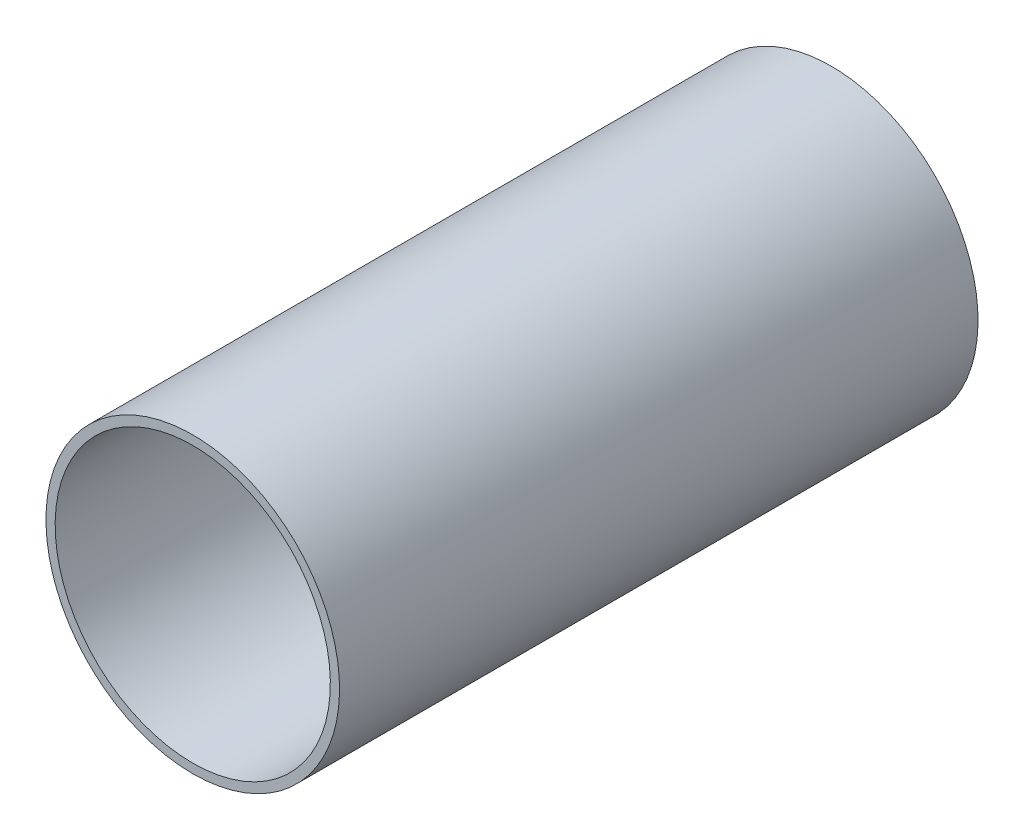
ISO-10303-21;
HEADER;
FILE_DESCRIPTION(('STEP AP214'),'2;1');
FILE_NAME('part.step','',(''),(''),'','','');
FILE_SCHEMA(('AUTOMOTIVE_DESIGN { 1 0 10303 214 1 1 1 1 }'));
ENDSEC;
DATA;
#1=APPLICATION_CONTEXT('core data for automotive mechanical design processes');
#2=APPLICATION_PROTOCOL_DEFINITION('international standard','automotive_design',2000,#1);
#3=PRODUCT_CONTEXT('',#1,'mechanical');
#4=PRODUCT('Part','Part','',(#3));
#5=PRODUCT_RELATED_PRODUCT_CATEGORY('part','',(#4));
#6=PRODUCT_DEFINITION_FORMATION('','',#4);
#7=PRODUCT_DEFINITION_CONTEXT('part definition',#1,'design');
#8=PRODUCT_DEFINITION('design','',#6,#7);
#9=PRODUCT_DEFINITION_SHAPE('','',#8);
#10=(LENGTH_UNIT() NAMED_UNIT(*) SI_UNIT(.MILLI.,.METRE.));
#11=(NAMED_UNIT(*) PLANE_ANGLE_UNIT() SI_UNIT($,.RADIAN.));
#12=(NAMED_UNIT(*) SI_UNIT($,.STERADIAN.) SOLID_ANGLE_UNIT());
#13=UNCERTAINTY_MEASURE_WITH_UNIT(LENGTH_MEASURE(1.E-05),#10,'distance_accuracy_value','');
#14=(GEOMETRIC_REPRESENTATION_CONTEXT(3) GLOBAL_UNCERTAINTY_ASSIGNED_CONTEXT((#13)) GLOBAL_UNIT_ASSIGNED_CONTEXT((#10,
#11,#12)) REPRESENTATION_CONTEXT('',''));
#15=CARTESIAN_POINT('',(0.,0.,0.));
#16=DIRECTION('',(0.,0.,1.));
#17=DIRECTION('',(1.,0.,0.));
#18=AXIS2_PLACEMENT_3D('',#15,#16,#17);
#19=CARTESIAN_POINT('',(134.62,-80.772,-0.045));
#20=DIRECTION('',(0.,0.,-1.));
#21=DIRECTION('',(0.,-1.,0.));
#22=AXIS2_PLACEMENT_3D('',#19,#20,#21);
#23=CYLINDRICAL_SURFACE('',#22,0.375);
#24=CARTESIAN_POINT('',(134.62,-80.772,-0.035));
#25=DIRECTION('',(0.,0.,-1.));
#26=DIRECTION('',(0.,-1.,0.));
#27=AXIS2_PLACEMENT_3D('',#24,#25,#26);
#28=CIRCLE('',#27,0.375);
#29=CARTESIAN_POINT('',(134.62,-81.147,-0.035));
#30=VERTEX_POINT('',#29);
#31=EDGE_CURVE('E64',#30,#30,#28,.T.);
#32=ORIENTED_EDGE('',*,*,#31,.T.);
#33=DIRECTION('',(0.,0.,1.));
#34=VECTOR('',#33,1.);
#35=CARTESIAN_POINT('',(134.62,-81.147,-0.045));
#36=LINE('',#35,#34);
#37=CARTESIAN_POINT('',(134.62,-81.147,1.705));
#38=VERTEX_POINT('',#37);
#39=EDGE_CURVE('E11',#30,#38,#36,.T.);
#40=ORIENTED_EDGE('',*,*,#39,.T.);
#41=CARTESIAN_POINT('',(134.62,-80.772,1.705));
#42=DIRECTION('',(0.,0.,-1.));
#43=DIRECTION('',(0.,-1.,0.));
#44=AXIS2_PLACEMENT_3D('',#41,#42,#43);
#45=CIRCLE('',#44,0.375);
#46=EDGE_CURVE('E25',#38,#38,#45,.T.);
#47=ORIENTED_EDGE('',*,*,#46,.F.);
#48=ORIENTED_EDGE('',*,*,#39,.F.);
#49=EDGE_LOOP('',(#32,#40,#47,#48));
#50=FACE_BOUND('',#49,.T.);
#51=ADVANCED_FACE('F17',(#50),#23,.F.);
#52=CARTESIAN_POINT('',(134.62,-81.172,1.705));
#53=DIRECTION('',(0.,0.,1.));
#54=DIRECTION('',(1.,0.,0.));
#55=AXIS2_PLACEMENT_3D('',#52,#53,#54);
#56=PLANE('',#55);
#57=ORIENTED_EDGE('',*,*,#46,.T.);
#58=EDGE_LOOP('',(#57));
#59=FACE_BOUND('',#58,.T.);
#60=CARTESIAN_POINT('',(134.62,-80.772,1.705));
#61=DIRECTION('',(0.,0.,1.));
#62=DIRECTION('',(0.,-1.,0.));
#63=AXIS2_PLACEMENT_3D('',#60,#61,#62);
#64=CIRCLE('',#63,0.4);
#65=CARTESIAN_POINT('',(134.62,-81.172,1.705));
#66=VERTEX_POINT('',#65);
#67=EDGE_CURVE('E56',#66,#66,#64,.T.);
#68=ORIENTED_EDGE('',*,*,#67,.T.);
#69=EDGE_LOOP('',(#68));
#70=FACE_BOUND('',#69,.T.);
#71=ADVANCED_FACE('F73',(#59,#70),#56,.T.);
#72=CARTESIAN_POINT('',(134.62,-81.172,-0.035));
#73=DIRECTION('',(0.,0.,1.));
#74=DIRECTION('',(1.,0.,0.));
#75=AXIS2_PLACEMENT_3D('',#72,#73,#74);
#76=PLANE('',#75);
#77=ORIENTED_EDGE('',*,*,#31,.F.);
#78=EDGE_LOOP('',(#77));
#79=FACE_BOUND('',#78,.T.);
#80=CARTESIAN_POINT('',(134.62,-80.772,-0.035));
#81=DIRECTION('',(0.,0.,1.));
#82=DIRECTION('',(0.,-1.,0.));
#83=AXIS2_PLACEMENT_3D('',#80,#81,#82);
#84=CIRCLE('',#83,0.4);
#85=CARTESIAN_POINT('',(134.62,-81.172,-0.035));
#86=VERTEX_POINT('',#85);
#87=EDGE_CURVE('E55',#86,#86,#84,.T.);
#88=ORIENTED_EDGE('',*,*,#87,.F.);
#89=EDGE_LOOP('',(#88));
#90=FACE_BOUND('',#89,.T.);
#91=ADVANCED_FACE('F82',(#79,#90),#76,.F.);
#92=CARTESIAN_POINT('',(134.62,-80.772,-0.035));
#93=DIRECTION('',(0.,0.,-1.));
#94=DIRECTION('',(0.,-1.,0.));
#95=AXIS2_PLACEMENT_3D('',#92,#93,#94);
#96=CYLINDRICAL_SURFACE('',#95,0.4);
#97=ORIENTED_EDGE('',*,*,#87,.T.);
#98=DIRECTION('',(0.,0.,1.));
#99=VECTOR('',#98,1.);
#100=CARTESIAN_POINT('',(134.62,-81.172,-0.035));
#101=LINE('',#100,#99);
#102=EDGE_CURVE('E52',#86,#66,#101,.T.);
#103=ORIENTED_EDGE('',*,*,#102,.T.);
#104=ORIENTED_EDGE('',*,*,#67,.F.);
#105=ORIENTED_EDGE('',*,*,#102,.F.);
#106=EDGE_LOOP('',(#97,#103,#104,#105));
#107=FACE_BOUND('',#106,.T.);
#108=ADVANCED_FACE('F53',(#107),#96,.T.);
#109=CLOSED_SHELL('',(#51,#71,#91,#108));
#110=MANIFOLD_SOLID_BREP('B1',#109);
#111=ADVANCED_BREP_SHAPE_REPRESENTATION('',(#18,#110),#14);
#112=SHAPE_DEFINITION_REPRESENTATION(#9,#111);
ENDSEC;
END-ISO-10303-21;
